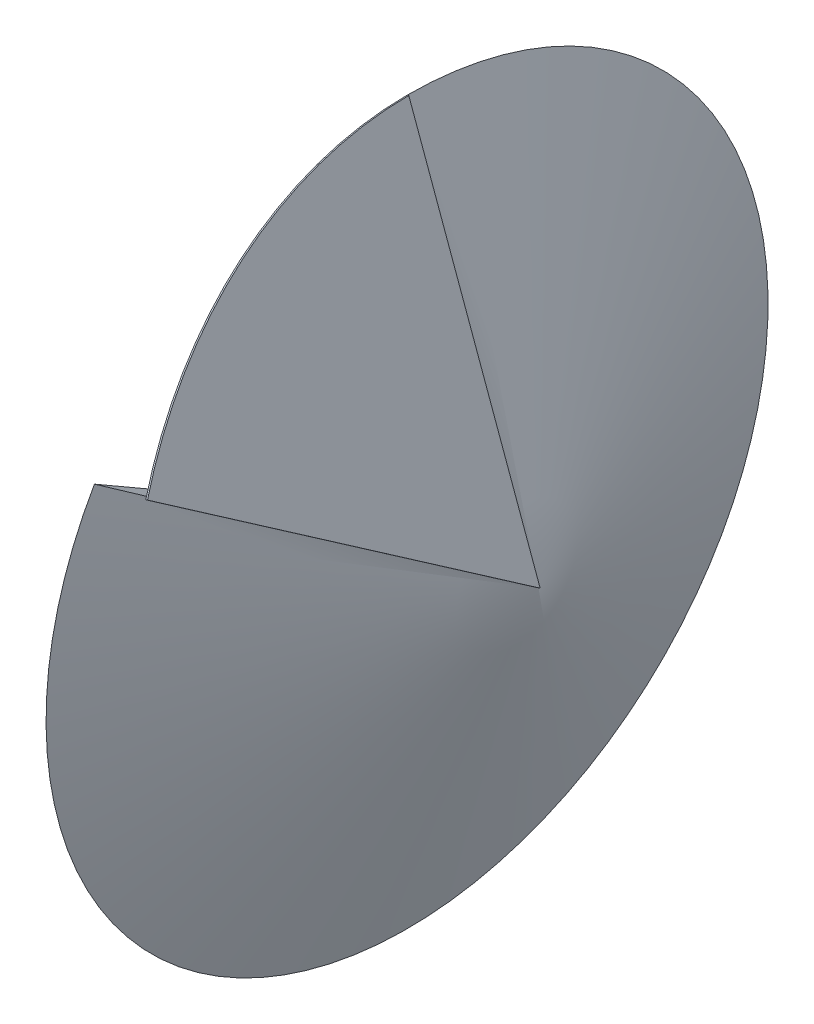
ISO-10303-21;
HEADER;
FILE_DESCRIPTION(('STEP AP214'),'2;1');
FILE_NAME('part.step','',(''),(''),'','','');
FILE_SCHEMA(('AUTOMOTIVE_DESIGN { 1 0 10303 214 1 1 1 1 }'));
ENDSEC;
DATA;
#1=APPLICATION_CONTEXT('core data for automotive mechanical design processes');
#2=APPLICATION_PROTOCOL_DEFINITION('international standard','automotive_design',2000,#1);
#3=PRODUCT_CONTEXT('',#1,'mechanical');
#4=PRODUCT('Part','Part','',(#3));
#5=PRODUCT_RELATED_PRODUCT_CATEGORY('part','',(#4));
#6=PRODUCT_DEFINITION_FORMATION('','',#4);
#7=PRODUCT_DEFINITION_CONTEXT('part definition',#1,'design');
#8=PRODUCT_DEFINITION('design','',#6,#7);
#9=PRODUCT_DEFINITION_SHAPE('','',#8);
#10=(LENGTH_UNIT() NAMED_UNIT(*) SI_UNIT(.MILLI.,.METRE.));
#11=(NAMED_UNIT(*) PLANE_ANGLE_UNIT() SI_UNIT($,.RADIAN.));
#12=(NAMED_UNIT(*) SI_UNIT($,.STERADIAN.) SOLID_ANGLE_UNIT());
#13=UNCERTAINTY_MEASURE_WITH_UNIT(LENGTH_MEASURE(1.E-05),#10,'distance_accuracy_value','');
#14=(GEOMETRIC_REPRESENTATION_CONTEXT(3) GLOBAL_UNCERTAINTY_ASSIGNED_CONTEXT((#13)) GLOBAL_UNIT_ASSIGNED_CONTEXT((#10,
#11,#12)) REPRESENTATION_CONTEXT('',''));
#15=CARTESIAN_POINT('',(0.,0.,0.));
#16=DIRECTION('',(0.,0.,1.));
#17=DIRECTION('',(1.,0.,0.));
#18=AXIS2_PLACEMENT_3D('',#15,#16,#17);
#19=CARTESIAN_POINT('',(73.7337394740259,0.342020143325135,0.));
#20=DIRECTION('',(0.,0.,1.));
#21=DIRECTION('',(0.,-1.,0.));
#22=AXIS2_PLACEMENT_3D('',#19,#20,#21);
#23=PLANE('',#22);
#24=DIRECTION('',(-0.342020143325666,0.939692620785909,0.));
#25=VECTOR('',#24,1.);
#26=CARTESIAN_POINT('',(72.79404685324,-5.30825383648903E-13,0.));
#27=LINE('',#26,#25);
#28=CARTESIAN_POINT('',(72.79404685324,-5.30825383648903E-13,0.));
#29=VERTEX_POINT('',#28);
#30=CARTESIAN_POINT('',(0.,200.,0.));
#31=VERTEX_POINT('',#30);
#32=EDGE_CURVE('E394',#29,#31,#27,.T.);
#33=ORIENTED_EDGE('',*,*,#32,.T.);
#34=DIRECTION('',(-0.939692620785909,-0.342020143325666,0.));
#35=VECTOR('',#34,1.);
#36=CARTESIAN_POINT('',(0.939692620785868,200.342020143326,0.));
#37=LINE('',#36,#35);
#38=CARTESIAN_POINT('',(0.939692620785868,200.342020143326,0.));
#39=VERTEX_POINT('',#38);
#40=EDGE_CURVE('E12',#39,#31,#37,.T.);
#41=ORIENTED_EDGE('',*,*,#40,.F.);
#42=DIRECTION('',(-0.342020143325666,0.939692620785909,0.));
#43=VECTOR('',#42,1.);
#44=CARTESIAN_POINT('',(73.7337394740259,0.342020143325135,0.));
#45=LINE('',#44,#43);
#46=CARTESIAN_POINT('',(73.7337394740259,0.342020143325135,0.));
#47=VERTEX_POINT('',#46);
#48=EDGE_CURVE('E408',#47,#39,#45,.T.);
#49=ORIENTED_EDGE('',*,*,#48,.F.);
#50=DIRECTION('',(-0.939692620785909,-0.342020143325666,0.));
#51=VECTOR('',#50,1.);
#52=CARTESIAN_POINT('',(73.7337394740259,0.342020143325135,0.));
#53=LINE('',#52,#51);
#54=EDGE_CURVE('E404',#47,#29,#53,.T.);
#55=ORIENTED_EDGE('',*,*,#54,.T.);
#56=EDGE_LOOP('',(#33,#41,#49,#55));
#57=FACE_BOUND('',#56,.T.);
#58=ADVANCED_FACE('F358',(#57),#23,.F.);
#59=CARTESIAN_POINT('',(73.7337394740259,0.342020143325135,0.));
#60=DIRECTION('',(-0.939692620785909,-0.342020143325666,0.));
#61=DIRECTION('',(0.342020143325666,-0.93969262078591,0.));
#62=AXIS2_PLACEMENT_3D('',#59,#60,#61);
#63=CYLINDRICAL_SURFACE('',#62,212.835554495183);
#64=CARTESIAN_POINT('',(72.79404685324,-5.30825383648903E-13,0.));
#65=DIRECTION('',(0.939692620785909,0.342020143325666,0.));
#66=DIRECTION('',(-0.342020143325666,0.93969262078591,0.));
#67=AXIS2_PLACEMENT_3D('',#64,#65,#66);
#68=CIRCLE('',#67,212.835554495183);
#69=CARTESIAN_POINT('',(32.489274485429,110.73645197682,177.234129854371));
#70=VERTEX_POINT('',#69);
#71=EDGE_CURVE('E391',#31,#70,#68,.T.);
#72=ORIENTED_EDGE('',*,*,#71,.T.);
#73=DIRECTION('',(-0.939692620785909,-0.342020143325666,0.));
#74=VECTOR('',#73,1.);
#75=CARTESIAN_POINT('',(33.4289671062149,111.078472120146,177.234129854371));
#76=LINE('',#75,#74);
#77=CARTESIAN_POINT('',(33.4289671062149,111.078472120146,177.234129854371));
#78=VERTEX_POINT('',#77);
#79=EDGE_CURVE('E365',#78,#70,#76,.T.);
#80=ORIENTED_EDGE('',*,*,#79,.F.);
#81=CARTESIAN_POINT('',(73.7337394740259,0.342020143325135,0.));
#82=DIRECTION('',(0.939692620785909,0.342020143325666,0.));
#83=DIRECTION('',(-0.342020143325666,0.93969262078591,0.));
#84=AXIS2_PLACEMENT_3D('',#81,#82,#83);
#85=CIRCLE('',#84,212.835554495183);
#86=EDGE_CURVE('E376',#39,#78,#85,.T.);
#87=ORIENTED_EDGE('',*,*,#86,.F.);
#88=ORIENTED_EDGE('',*,*,#40,.T.);
#89=EDGE_LOOP('',(#72,#80,#87,#88));
#90=FACE_BOUND('',#89,.T.);
#91=ADVANCED_FACE('F400',(#90),#63,.T.);
#92=CARTESIAN_POINT('',(73.7337394740259,0.342020143325135,0.));
#93=DIRECTION('',(-0.28480975670991,0.782508375400849,-0.553682259884101));
#94=DIRECTION('',(0.,0.577604283511668,0.816316906396635));
#95=AXIS2_PLACEMENT_3D('',#92,#93,#94);
#96=PLANE('',#95);
#97=DIRECTION('',(0.189370485882439,-0.520291133873156,-0.83272801987782));
#98=VECTOR('',#97,1.);
#99=CARTESIAN_POINT('',(72.79404685324,-5.30825383648903E-13,0.));
#100=LINE('',#99,#98);
#101=EDGE_CURVE('E395',#70,#29,#100,.T.);
#102=ORIENTED_EDGE('',*,*,#101,.T.);
#103=ORIENTED_EDGE('',*,*,#54,.F.);
#104=DIRECTION('',(0.189370485882439,-0.520291133873156,-0.83272801987782));
#105=VECTOR('',#104,1.);
#106=CARTESIAN_POINT('',(73.7337394740259,0.342020143325135,0.));
#107=LINE('',#106,#105);
#108=EDGE_CURVE('E372',#78,#47,#107,.T.);
#109=ORIENTED_EDGE('',*,*,#108,.F.);
#110=ORIENTED_EDGE('',*,*,#79,.T.);
#111=EDGE_LOOP('',(#102,#103,#109,#110));
#112=FACE_BOUND('',#111,.T.);
#113=ADVANCED_FACE('F413',(#112),#96,.F.);
#114=CARTESIAN_POINT('',(73.7337394740259,0.342020143325135,0.));
#115=DIRECTION('',(0.939692620785909,0.342020143325666,0.));
#116=DIRECTION('',(-0.342020143325666,0.93969262078591,0.));
#117=AXIS2_PLACEMENT_3D('',#114,#115,#116);
#118=PLANE('',#117);
#119=ORIENTED_EDGE('',*,*,#48,.T.);
#120=ORIENTED_EDGE('',*,*,#86,.T.);
#121=ORIENTED_EDGE('',*,*,#108,.T.);
#122=EDGE_LOOP('',(#119,#120,#121));
#123=FACE_BOUND('',#122,.T.);
#124=ADVANCED_FACE('F414',(#123),#118,.T.);
#125=CARTESIAN_POINT('',(72.79404685324,-5.30825383648903E-13,0.));
#126=DIRECTION('',(0.939692620785909,0.342020143325666,0.));
#127=DIRECTION('',(-0.342020143325666,0.93969262078591,0.));
#128=AXIS2_PLACEMENT_3D('',#125,#126,#127);
#129=PLANE('',#128);
#130=ORIENTED_EDGE('',*,*,#32,.F.);
#131=ORIENTED_EDGE('',*,*,#101,.F.);
#132=ORIENTED_EDGE('',*,*,#71,.F.);
#133=EDGE_LOOP('',(#130,#131,#132));
#134=FACE_BOUND('',#133,.T.);
#135=ADVANCED_FACE('F392',(#134),#129,.F.);
#136=CLOSED_SHELL('',(#58,#91,#113,#124,#135));
#137=MANIFOLD_SOLID_BREP('B2',#136);
#138=CARTESIAN_POINT('',(0.,100.000000000002,173.205080756887));
#139=DIRECTION('',(-1.,0.,0.));
#140=DIRECTION('',(0.,0.,1.));
#141=AXIS2_PLACEMENT_3D('',#138,#139,#140);
#142=PLANE('',#141);
#143=DIRECTION('',(0.,-1.,0.));
#144=VECTOR('',#143,1.);
#145=CARTESIAN_POINT('',(0.,200.,0.));
#146=LINE('',#145,#144);
#147=CARTESIAN_POINT('',(0.,200.,0.));
#148=VERTEX_POINT('',#147);
#149=CARTESIAN_POINT('',(0.,0.,0.));
#150=VERTEX_POINT('',#149);
#151=EDGE_CURVE('E473',#148,#150,#146,.T.);
#152=ORIENTED_EDGE('',*,*,#151,.F.);
#153=CARTESIAN_POINT('',(0.,0.,0.));
#154=DIRECTION('',(1.,0.,0.));
#155=DIRECTION('',(0.,0.,-1.));
#156=AXIS2_PLACEMENT_3D('',#153,#154,#155);
#157=CIRCLE('',#156,200.);
#158=CARTESIAN_POINT('',(0.,100.000000000002,173.205080756887));
#159=VERTEX_POINT('',#158);
#160=EDGE_CURVE('E356',#159,#148,#157,.T.);
#161=ORIENTED_EDGE('',*,*,#160,.F.);
#162=DIRECTION('',(0.,-0.50000000000001,-0.866025403784433));
#163=VECTOR('',#162,1.);
#164=CARTESIAN_POINT('',(0.,100.000000000002,173.205080756887));
#165=LINE('',#164,#163);
#166=EDGE_CURVE('E474',#159,#150,#165,.T.);
#167=ORIENTED_EDGE('',*,*,#166,.T.);
#168=EDGE_LOOP('',(#152,#161,#167));
#169=FACE_BOUND('',#168,.T.);
#170=ADVANCED_FACE('F445',(#169),#142,.T.);
#171=CARTESIAN_POINT('',(72.7940468532415,0.,0.));
#172=DIRECTION('',(-1.,0.,0.));
#173=DIRECTION('',(0.,0.,1.));
#174=AXIS2_PLACEMENT_3D('',#171,#172,#173);
#175=CONICAL_SURFACE('',#174,0.,1.22173047639603);
#176=DIRECTION('',(-0.342020143325673,0.469846310392963,0.813797681349367));
#177=VECTOR('',#176,1.);
#178=CARTESIAN_POINT('',(72.7940468532415,0.,0.));
#179=LINE('',#178,#177);
#180=CARTESIAN_POINT('',(72.7940468532415,0.,0.));
#181=VERTEX_POINT('',#180);
#182=EDGE_CURVE('E453',#181,#159,#179,.T.);
#183=ORIENTED_EDGE('',*,*,#182,.T.);
#184=ORIENTED_EDGE('',*,*,#160,.T.);
#185=DIRECTION('',(-0.342020143325673,0.939692620785907,0.));
#186=VECTOR('',#185,1.);
#187=CARTESIAN_POINT('',(72.7940468532415,0.,0.));
#188=LINE('',#187,#186);
#189=EDGE_CURVE('E465',#181,#148,#188,.T.);
#190=ORIENTED_EDGE('',*,*,#189,.F.);
#191=EDGE_LOOP('',(#183,#184,#190));
#192=FACE_BOUND('',#191,.T.);
#193=ADVANCED_FACE('F447',(#192),#175,.T.);
#194=CARTESIAN_POINT('',(0.,0.,0.));
#195=DIRECTION('',(0.,-0.866025403784433,0.50000000000001));
#196=DIRECTION('',(1.,0.,0.));
#197=AXIS2_PLACEMENT_3D('',#194,#195,#196);
#198=PLANE('',#197);
#199=ORIENTED_EDGE('',*,*,#166,.F.);
#200=ORIENTED_EDGE('',*,*,#182,.F.);
#201=DIRECTION('',(1.,0.,0.));
#202=VECTOR('',#201,1.);
#203=CARTESIAN_POINT('',(0.,0.,0.));
#204=LINE('',#203,#202);
#205=EDGE_CURVE('E478',#150,#181,#204,.T.);
#206=ORIENTED_EDGE('',*,*,#205,.F.);
#207=EDGE_LOOP('',(#199,#200,#206));
#208=FACE_BOUND('',#207,.T.);
#209=ADVANCED_FACE('F483',(#208),#198,.F.);
#210=CARTESIAN_POINT('',(0.,0.,0.));
#211=DIRECTION('',(0.,0.,1.));
#212=DIRECTION('',(1.,0.,0.));
#213=AXIS2_PLACEMENT_3D('',#210,#211,#212);
#214=PLANE('',#213);
#215=ORIENTED_EDGE('',*,*,#151,.T.);
#216=ORIENTED_EDGE('',*,*,#205,.T.);
#217=ORIENTED_EDGE('',*,*,#189,.T.);
#218=EDGE_LOOP('',(#215,#216,#217));
#219=FACE_BOUND('',#218,.T.);
#220=ADVANCED_FACE('F477',(#219),#214,.T.);
#221=CLOSED_SHELL('',(#170,#193,#209,#220));
#222=MANIFOLD_SOLID_BREP('B6',#221);
#223=ADVANCED_BREP_SHAPE_REPRESENTATION('',(#18,#137,#222),#14);
#224=SHAPE_DEFINITION_REPRESENTATION(#9,#223);
ENDSEC;
END-ISO-10303-21;
